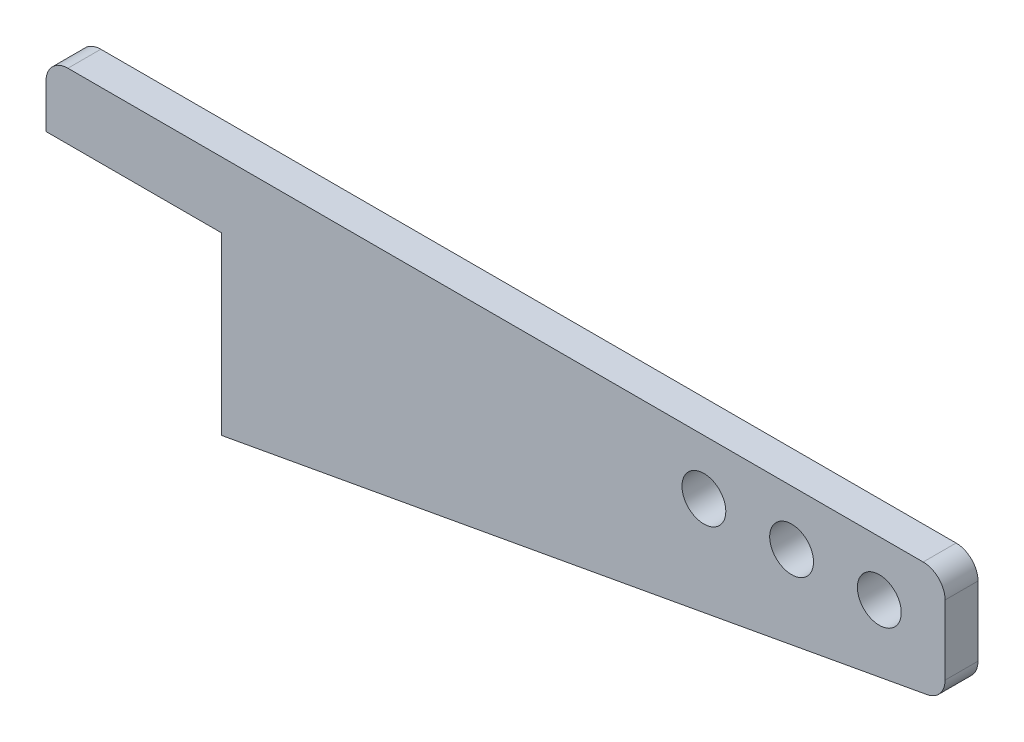
ISO-10303-21;
HEADER;
FILE_DESCRIPTION(('STEP AP214'),'2;1');
FILE_NAME('part.step','',(''),(''),'','','');
FILE_SCHEMA(('AUTOMOTIVE_DESIGN { 1 0 10303 214 1 1 1 1 }'));
ENDSEC;
DATA;
#1=APPLICATION_CONTEXT('core data for automotive mechanical design processes');
#2=APPLICATION_PROTOCOL_DEFINITION('international standard','automotive_design',2000,#1);
#3=PRODUCT_CONTEXT('',#1,'mechanical');
#4=PRODUCT('Part','Part','',(#3));
#5=PRODUCT_RELATED_PRODUCT_CATEGORY('part','',(#4));
#6=PRODUCT_DEFINITION_FORMATION('','',#4);
#7=PRODUCT_DEFINITION_CONTEXT('part definition',#1,'design');
#8=PRODUCT_DEFINITION('design','',#6,#7);
#9=PRODUCT_DEFINITION_SHAPE('','',#8);
#10=(LENGTH_UNIT() NAMED_UNIT(*) SI_UNIT(.MILLI.,.METRE.));
#11=(NAMED_UNIT(*) PLANE_ANGLE_UNIT() SI_UNIT($,.RADIAN.));
#12=(NAMED_UNIT(*) SI_UNIT($,.STERADIAN.) SOLID_ANGLE_UNIT());
#13=UNCERTAINTY_MEASURE_WITH_UNIT(LENGTH_MEASURE(1.E-05),#10,'distance_accuracy_value','');
#14=(GEOMETRIC_REPRESENTATION_CONTEXT(3) GLOBAL_UNCERTAINTY_ASSIGNED_CONTEXT((#13)) GLOBAL_UNIT_ASSIGNED_CONTEXT((#10,
#11,#12)) REPRESENTATION_CONTEXT('',''));
#15=CARTESIAN_POINT('',(0.,0.,0.));
#16=DIRECTION('',(0.,0.,1.));
#17=DIRECTION('',(1.,0.,0.));
#18=AXIS2_PLACEMENT_3D('',#15,#16,#17);
#19=CARTESIAN_POINT('',(0.,0.,15.));
#20=DIRECTION('',(0.,0.,-1.));
#21=DIRECTION('',(-1.,0.,0.));
#22=AXIS2_PLACEMENT_3D('',#19,#20,#21);
#23=PLANE('',#22);
#24=DIRECTION('',(-1.,0.,0.));
#25=VECTOR('',#24,1.);
#26=CARTESIAN_POINT('',(0.,0.,15.));
#27=LINE('',#26,#25);
#28=CARTESIAN_POINT('',(400.,0.,15.));
#29=VERTEX_POINT('',#28);
#30=CARTESIAN_POINT('',(9.99999999999999,0.,15.));
#31=VERTEX_POINT('',#30);
#32=EDGE_CURVE('E186',#29,#31,#27,.T.);
#33=ORIENTED_EDGE('',*,*,#32,.T.);
#34=CARTESIAN_POINT('',(9.99999999999999,-10.,15.));
#35=DIRECTION('',(0.,0.,-1.));
#36=DIRECTION('',(-1.,0.,0.));
#37=AXIS2_PLACEMENT_3D('',#34,#35,#36);
#38=CIRCLE('',#37,10.);
#39=CARTESIAN_POINT('',(0.,-9.99999999999999,15.));
#40=VERTEX_POINT('',#39);
#41=EDGE_CURVE('E123',#31,#40,#38,.F.);
#42=ORIENTED_EDGE('',*,*,#41,.T.);
#43=DIRECTION('',(0.,-1.,0.));
#44=VECTOR('',#43,1.);
#45=CARTESIAN_POINT('',(0.,-30.,15.));
#46=LINE('',#45,#44);
#47=CARTESIAN_POINT('',(0.,-30.,15.));
#48=VERTEX_POINT('',#47);
#49=EDGE_CURVE('E116',#40,#48,#46,.T.);
#50=ORIENTED_EDGE('',*,*,#49,.T.);
#51=DIRECTION('',(1.,0.,0.));
#52=VECTOR('',#51,1.);
#53=CARTESIAN_POINT('',(80.,-30.,15.));
#54=LINE('',#53,#52);
#55=CARTESIAN_POINT('',(80.,-30.,15.));
#56=VERTEX_POINT('',#55);
#57=EDGE_CURVE('E120',#48,#56,#54,.T.);
#58=ORIENTED_EDGE('',*,*,#57,.T.);
#59=DIRECTION('',(0.,-1.,0.));
#60=VECTOR('',#59,1.);
#61=CARTESIAN_POINT('',(80.,-110.,15.));
#62=LINE('',#61,#60);
#63=CARTESIAN_POINT('',(80.,-110.,15.));
#64=VERTEX_POINT('',#63);
#65=EDGE_CURVE('E137',#56,#64,#62,.T.);
#66=ORIENTED_EDGE('',*,*,#65,.T.);
#67=DIRECTION('',(0.983869910099908,0.178885438199983,0.));
#68=VECTOR('',#67,1.);
#69=CARTESIAN_POINT('',(410.,-50.,15.));
#70=LINE('',#69,#68);
#71=CARTESIAN_POINT('',(401.788854382,-51.4929355669091,15.));
#72=VERTEX_POINT('',#71);
#73=EDGE_CURVE('E192',#64,#72,#70,.T.);
#74=ORIENTED_EDGE('',*,*,#73,.T.);
#75=CARTESIAN_POINT('',(400.,-41.6542364659101,15.));
#76=DIRECTION('',(0.,0.,-1.));
#77=DIRECTION('',(-1.,0.,0.));
#78=AXIS2_PLACEMENT_3D('',#75,#76,#77);
#79=CIRCLE('',#78,10.);
#80=CARTESIAN_POINT('',(410.,-41.65423646591,15.));
#81=VERTEX_POINT('',#80);
#82=EDGE_CURVE('E68',#72,#81,#79,.F.);
#83=ORIENTED_EDGE('',*,*,#82,.T.);
#84=DIRECTION('',(0.,1.,0.));
#85=VECTOR('',#84,1.);
#86=CARTESIAN_POINT('',(410.,0.,15.));
#87=LINE('',#86,#85);
#88=CARTESIAN_POINT('',(410.,-9.99999999999999,15.));
#89=VERTEX_POINT('',#88);
#90=EDGE_CURVE('E170',#81,#89,#87,.T.);
#91=ORIENTED_EDGE('',*,*,#90,.T.);
#92=CARTESIAN_POINT('',(400.,-10.,15.));
#93=DIRECTION('',(0.,0.,-1.));
#94=DIRECTION('',(-1.,0.,0.));
#95=AXIS2_PLACEMENT_3D('',#92,#93,#94);
#96=CIRCLE('',#95,10.);
#97=EDGE_CURVE('E161',#89,#29,#96,.F.);
#98=ORIENTED_EDGE('',*,*,#97,.T.);
#99=EDGE_LOOP('',(#33,#42,#50,#58,#66,#74,#83,#91,#98));
#100=FACE_BOUND('',#99,.T.);
#101=CARTESIAN_POINT('',(300.,-25.,15.));
#102=DIRECTION('',(0.,0.,1.));
#103=DIRECTION('',(1.,0.,0.));
#104=AXIS2_PLACEMENT_3D('',#101,#102,#103);
#105=CIRCLE('',#104,9.99999999999998);
#106=CARTESIAN_POINT('',(310.,-25.,15.));
#107=VERTEX_POINT('',#106);
#108=EDGE_CURVE('E198',#107,#107,#105,.T.);
#109=ORIENTED_EDGE('',*,*,#108,.F.);
#110=EDGE_LOOP('',(#109));
#111=FACE_BOUND('',#110,.T.);
#112=CARTESIAN_POINT('',(340.,-25.,15.));
#113=DIRECTION('',(0.,0.,1.));
#114=DIRECTION('',(1.,0.,0.));
#115=AXIS2_PLACEMENT_3D('',#112,#113,#114);
#116=CIRCLE('',#115,9.99999999999998);
#117=CARTESIAN_POINT('',(350.,-25.,15.));
#118=VERTEX_POINT('',#117);
#119=EDGE_CURVE('E339',#118,#118,#116,.T.);
#120=ORIENTED_EDGE('',*,*,#119,.F.);
#121=EDGE_LOOP('',(#120));
#122=FACE_BOUND('',#121,.T.);
#123=CARTESIAN_POINT('',(380.,-25.,15.));
#124=DIRECTION('',(0.,0.,1.));
#125=DIRECTION('',(1.,0.,0.));
#126=AXIS2_PLACEMENT_3D('',#123,#124,#125);
#127=CIRCLE('',#126,9.99999999999998);
#128=CARTESIAN_POINT('',(390.,-25.,15.));
#129=VERTEX_POINT('',#128);
#130=EDGE_CURVE('E330',#129,#129,#127,.T.);
#131=ORIENTED_EDGE('',*,*,#130,.F.);
#132=EDGE_LOOP('',(#131));
#133=FACE_BOUND('',#132,.T.);
#134=ADVANCED_FACE('F46',(#100,#111,#122,#133),#23,.F.);
#135=CARTESIAN_POINT('',(0.,0.,0.));
#136=DIRECTION('',(0.,0.,-1.));
#137=DIRECTION('',(-1.,0.,0.));
#138=AXIS2_PLACEMENT_3D('',#135,#136,#137);
#139=PLANE('',#138);
#140=CARTESIAN_POINT('',(340.,-25.,0.));
#141=DIRECTION('',(0.,0.,1.));
#142=DIRECTION('',(1.,0.,0.));
#143=AXIS2_PLACEMENT_3D('',#140,#141,#142);
#144=CIRCLE('',#143,9.99999999999998);
#145=CARTESIAN_POINT('',(350.,-25.,0.));
#146=VERTEX_POINT('',#145);
#147=EDGE_CURVE('E336',#146,#146,#144,.T.);
#148=ORIENTED_EDGE('',*,*,#147,.T.);
#149=EDGE_LOOP('',(#148));
#150=FACE_BOUND('',#149,.T.);
#151=DIRECTION('',(0.,-1.,0.));
#152=VECTOR('',#151,1.);
#153=CARTESIAN_POINT('',(0.,-30.,0.));
#154=LINE('',#153,#152);
#155=CARTESIAN_POINT('',(0.,-9.99999999999999,0.));
#156=VERTEX_POINT('',#155);
#157=CARTESIAN_POINT('',(0.,-30.,0.));
#158=VERTEX_POINT('',#157);
#159=EDGE_CURVE('E141',#156,#158,#154,.T.);
#160=ORIENTED_EDGE('',*,*,#159,.F.);
#161=CARTESIAN_POINT('',(9.99999999999999,-10.,0.));
#162=DIRECTION('',(0.,0.,-1.));
#163=DIRECTION('',(-1.,0.,0.));
#164=AXIS2_PLACEMENT_3D('',#161,#162,#163);
#165=CIRCLE('',#164,10.);
#166=CARTESIAN_POINT('',(9.99999999999999,0.,0.));
#167=VERTEX_POINT('',#166);
#168=EDGE_CURVE('E154',#156,#167,#165,.T.);
#169=ORIENTED_EDGE('',*,*,#168,.T.);
#170=DIRECTION('',(-1.,0.,0.));
#171=VECTOR('',#170,1.);
#172=CARTESIAN_POINT('',(0.,0.,0.));
#173=LINE('',#172,#171);
#174=CARTESIAN_POINT('',(400.,0.,0.));
#175=VERTEX_POINT('',#174);
#176=EDGE_CURVE('E128',#175,#167,#173,.T.);
#177=ORIENTED_EDGE('',*,*,#176,.F.);
#178=CARTESIAN_POINT('',(400.,-10.,0.));
#179=DIRECTION('',(0.,0.,-1.));
#180=DIRECTION('',(-1.,0.,0.));
#181=AXIS2_PLACEMENT_3D('',#178,#179,#180);
#182=CIRCLE('',#181,10.);
#183=CARTESIAN_POINT('',(410.,-9.99999999999999,0.));
#184=VERTEX_POINT('',#183);
#185=EDGE_CURVE('E145',#175,#184,#182,.T.);
#186=ORIENTED_EDGE('',*,*,#185,.T.);
#187=DIRECTION('',(0.,1.,0.));
#188=VECTOR('',#187,1.);
#189=CARTESIAN_POINT('',(410.,0.,0.));
#190=LINE('',#189,#188);
#191=CARTESIAN_POINT('',(410.,-41.65423646591,0.));
#192=VERTEX_POINT('',#191);
#193=EDGE_CURVE('E169',#192,#184,#190,.T.);
#194=ORIENTED_EDGE('',*,*,#193,.F.);
#195=CARTESIAN_POINT('',(400.,-41.6542364659101,0.));
#196=DIRECTION('',(0.,0.,-1.));
#197=DIRECTION('',(-1.,0.,0.));
#198=AXIS2_PLACEMENT_3D('',#195,#196,#197);
#199=CIRCLE('',#198,10.);
#200=CARTESIAN_POINT('',(401.788854382,-51.4929355669091,0.));
#201=VERTEX_POINT('',#200);
#202=EDGE_CURVE('E152',#192,#201,#199,.T.);
#203=ORIENTED_EDGE('',*,*,#202,.T.);
#204=DIRECTION('',(0.983869910099908,0.178885438199983,0.));
#205=VECTOR('',#204,1.);
#206=CARTESIAN_POINT('',(410.,-50.,0.));
#207=LINE('',#206,#205);
#208=CARTESIAN_POINT('',(80.,-110.,0.));
#209=VERTEX_POINT('',#208);
#210=EDGE_CURVE('E178',#209,#201,#207,.T.);
#211=ORIENTED_EDGE('',*,*,#210,.F.);
#212=DIRECTION('',(0.,-1.,0.));
#213=VECTOR('',#212,1.);
#214=CARTESIAN_POINT('',(80.,-110.,0.));
#215=LINE('',#214,#213);
#216=CARTESIAN_POINT('',(80.,-30.,0.));
#217=VERTEX_POINT('',#216);
#218=EDGE_CURVE('E182',#217,#209,#215,.T.);
#219=ORIENTED_EDGE('',*,*,#218,.F.);
#220=DIRECTION('',(1.,0.,0.));
#221=VECTOR('',#220,1.);
#222=CARTESIAN_POINT('',(80.,-30.,0.));
#223=LINE('',#222,#221);
#224=EDGE_CURVE('E197',#158,#217,#223,.T.);
#225=ORIENTED_EDGE('',*,*,#224,.F.);
#226=EDGE_LOOP('',(#160,#169,#177,#186,#194,#203,#211,#219,#225));
#227=FACE_BOUND('',#226,.T.);
#228=CARTESIAN_POINT('',(300.,-25.,0.));
#229=DIRECTION('',(0.,0.,1.));
#230=DIRECTION('',(1.,0.,0.));
#231=AXIS2_PLACEMENT_3D('',#228,#229,#230);
#232=CIRCLE('',#231,9.99999999999998);
#233=CARTESIAN_POINT('',(310.,-25.,0.));
#234=VERTEX_POINT('',#233);
#235=EDGE_CURVE('E342',#234,#234,#232,.T.);
#236=ORIENTED_EDGE('',*,*,#235,.T.);
#237=EDGE_LOOP('',(#236));
#238=FACE_BOUND('',#237,.T.);
#239=CARTESIAN_POINT('',(380.,-25.,0.));
#240=DIRECTION('',(0.,0.,1.));
#241=DIRECTION('',(1.,0.,0.));
#242=AXIS2_PLACEMENT_3D('',#239,#240,#241);
#243=CIRCLE('',#242,9.99999999999998);
#244=CARTESIAN_POINT('',(390.,-25.,0.));
#245=VERTEX_POINT('',#244);
#246=EDGE_CURVE('E333',#245,#245,#243,.T.);
#247=ORIENTED_EDGE('',*,*,#246,.T.);
#248=EDGE_LOOP('',(#247));
#249=FACE_BOUND('',#248,.T.);
#250=ADVANCED_FACE('F173',(#150,#227,#238,#249),#139,.T.);
#251=CARTESIAN_POINT('',(0.,-30.,15.));
#252=DIRECTION('',(1.,0.,0.));
#253=DIRECTION('',(0.,1.,0.));
#254=AXIS2_PLACEMENT_3D('',#251,#252,#253);
#255=PLANE('',#254);
#256=ORIENTED_EDGE('',*,*,#49,.F.);
#257=DIRECTION('',(0.,0.,-1.));
#258=VECTOR('',#257,1.);
#259=CARTESIAN_POINT('',(0.,-9.99999999999999,15.));
#260=LINE('',#259,#258);
#261=EDGE_CURVE('E143',#40,#156,#260,.T.);
#262=ORIENTED_EDGE('',*,*,#261,.T.);
#263=ORIENTED_EDGE('',*,*,#159,.T.);
#264=DIRECTION('',(0.,0.,-1.));
#265=VECTOR('',#264,1.);
#266=CARTESIAN_POINT('',(0.,-30.,15.));
#267=LINE('',#266,#265);
#268=EDGE_CURVE('E133',#48,#158,#267,.T.);
#269=ORIENTED_EDGE('',*,*,#268,.F.);
#270=EDGE_LOOP('',(#256,#262,#263,#269));
#271=FACE_BOUND('',#270,.T.);
#272=ADVANCED_FACE('F139',(#271),#255,.F.);
#273=CARTESIAN_POINT('',(80.,-30.,15.));
#274=DIRECTION('',(0.,1.,0.));
#275=DIRECTION('',(0.,0.,1.));
#276=AXIS2_PLACEMENT_3D('',#273,#274,#275);
#277=PLANE('',#276);
#278=ORIENTED_EDGE('',*,*,#224,.T.);
#279=DIRECTION('',(0.,0.,-1.));
#280=VECTOR('',#279,1.);
#281=CARTESIAN_POINT('',(80.,-30.,15.));
#282=LINE('',#281,#280);
#283=EDGE_CURVE('E135',#56,#217,#282,.T.);
#284=ORIENTED_EDGE('',*,*,#283,.F.);
#285=ORIENTED_EDGE('',*,*,#57,.F.);
#286=ORIENTED_EDGE('',*,*,#268,.T.);
#287=EDGE_LOOP('',(#278,#284,#285,#286));
#288=FACE_BOUND('',#287,.T.);
#289=ADVANCED_FACE('F132',(#288),#277,.F.);
#290=CARTESIAN_POINT('',(80.,-110.,15.));
#291=DIRECTION('',(1.,0.,0.));
#292=DIRECTION('',(0.,1.,0.));
#293=AXIS2_PLACEMENT_3D('',#290,#291,#292);
#294=PLANE('',#293);
#295=ORIENTED_EDGE('',*,*,#218,.T.);
#296=DIRECTION('',(0.,0.,-1.));
#297=VECTOR('',#296,1.);
#298=CARTESIAN_POINT('',(80.,-110.,15.));
#299=LINE('',#298,#297);
#300=EDGE_CURVE('E147',#64,#209,#299,.T.);
#301=ORIENTED_EDGE('',*,*,#300,.F.);
#302=ORIENTED_EDGE('',*,*,#65,.F.);
#303=ORIENTED_EDGE('',*,*,#283,.T.);
#304=EDGE_LOOP('',(#295,#301,#302,#303));
#305=FACE_BOUND('',#304,.T.);
#306=ADVANCED_FACE('F201',(#305),#294,.F.);
#307=CARTESIAN_POINT('',(410.,-50.,15.));
#308=DIRECTION('',(-0.178885438199983,0.983869910099907,0.));
#309=DIRECTION('',(-0.983869910099907,-0.178885438199983,0.));
#310=AXIS2_PLACEMENT_3D('',#307,#308,#309);
#311=PLANE('',#310);
#312=ORIENTED_EDGE('',*,*,#210,.T.);
#313=DIRECTION('',(0.,0.,-1.));
#314=VECTOR('',#313,1.);
#315=CARTESIAN_POINT('',(401.788854382,-51.4929355669091,15.));
#316=LINE('',#315,#314);
#317=EDGE_CURVE('E13',#201,#72,#316,.F.);
#318=ORIENTED_EDGE('',*,*,#317,.T.);
#319=ORIENTED_EDGE('',*,*,#73,.F.);
#320=ORIENTED_EDGE('',*,*,#300,.T.);
#321=EDGE_LOOP('',(#312,#318,#319,#320));
#322=FACE_BOUND('',#321,.T.);
#323=ADVANCED_FACE('F203',(#322),#311,.F.);
#324=CARTESIAN_POINT('',(410.,0.,15.));
#325=DIRECTION('',(-1.,0.,0.));
#326=DIRECTION('',(0.,-1.,0.));
#327=AXIS2_PLACEMENT_3D('',#324,#325,#326);
#328=PLANE('',#327);
#329=ORIENTED_EDGE('',*,*,#90,.F.);
#330=DIRECTION('',(0.,0.,-1.));
#331=VECTOR('',#330,1.);
#332=CARTESIAN_POINT('',(410.,-41.65423646591,15.));
#333=LINE('',#332,#331);
#334=EDGE_CURVE('E54',#81,#192,#333,.T.);
#335=ORIENTED_EDGE('',*,*,#334,.T.);
#336=ORIENTED_EDGE('',*,*,#193,.T.);
#337=DIRECTION('',(0.,0.,-1.));
#338=VECTOR('',#337,1.);
#339=CARTESIAN_POINT('',(410.,-9.99999999999999,15.));
#340=LINE('',#339,#338);
#341=EDGE_CURVE('E61',#184,#89,#340,.F.);
#342=ORIENTED_EDGE('',*,*,#341,.T.);
#343=EDGE_LOOP('',(#329,#335,#336,#342));
#344=FACE_BOUND('',#343,.T.);
#345=ADVANCED_FACE('F168',(#344),#328,.F.);
#346=CARTESIAN_POINT('',(0.,0.,15.));
#347=DIRECTION('',(0.,-1.,0.));
#348=DIRECTION('',(0.,0.,-1.));
#349=AXIS2_PLACEMENT_3D('',#346,#347,#348);
#350=PLANE('',#349);
#351=ORIENTED_EDGE('',*,*,#176,.T.);
#352=DIRECTION('',(0.,0.,-1.));
#353=VECTOR('',#352,1.);
#354=CARTESIAN_POINT('',(9.99999999999999,0.,15.));
#355=LINE('',#354,#353);
#356=EDGE_CURVE('E159',#167,#31,#355,.F.);
#357=ORIENTED_EDGE('',*,*,#356,.T.);
#358=ORIENTED_EDGE('',*,*,#32,.F.);
#359=DIRECTION('',(0.,0.,-1.));
#360=VECTOR('',#359,1.);
#361=CARTESIAN_POINT('',(400.,0.,15.));
#362=LINE('',#361,#360);
#363=EDGE_CURVE('E156',#29,#175,#362,.T.);
#364=ORIENTED_EDGE('',*,*,#363,.T.);
#365=EDGE_LOOP('',(#351,#357,#358,#364));
#366=FACE_BOUND('',#365,.T.);
#367=ADVANCED_FACE('F226',(#366),#350,.F.);
#368=CARTESIAN_POINT('',(300.,-25.,15.));
#369=DIRECTION('',(0.,0.,-1.));
#370=DIRECTION('',(-1.,0.,0.));
#371=AXIS2_PLACEMENT_3D('',#368,#369,#370);
#372=CYLINDRICAL_SURFACE('',#371,9.99999999999998);
#373=ORIENTED_EDGE('',*,*,#108,.T.);
#374=EDGE_LOOP('',(#373));
#375=FACE_BOUND('',#374,.T.);
#376=ORIENTED_EDGE('',*,*,#235,.F.);
#377=EDGE_LOOP('',(#376));
#378=FACE_BOUND('',#377,.T.);
#379=ADVANCED_FACE('F223',(#375,#378),#372,.F.);
#380=CARTESIAN_POINT('',(340.,-25.,15.));
#381=DIRECTION('',(0.,0.,-1.));
#382=DIRECTION('',(-1.,0.,0.));
#383=AXIS2_PLACEMENT_3D('',#380,#381,#382);
#384=CYLINDRICAL_SURFACE('',#383,9.99999999999998);
#385=ORIENTED_EDGE('',*,*,#119,.T.);
#386=EDGE_LOOP('',(#385));
#387=FACE_BOUND('',#386,.T.);
#388=ORIENTED_EDGE('',*,*,#147,.F.);
#389=EDGE_LOOP('',(#388));
#390=FACE_BOUND('',#389,.T.);
#391=ADVANCED_FACE('F270',(#387,#390),#384,.F.);
#392=CARTESIAN_POINT('',(380.,-25.,15.));
#393=DIRECTION('',(0.,0.,-1.));
#394=DIRECTION('',(-1.,0.,0.));
#395=AXIS2_PLACEMENT_3D('',#392,#393,#394);
#396=CYLINDRICAL_SURFACE('',#395,9.99999999999998);
#397=ORIENTED_EDGE('',*,*,#130,.T.);
#398=EDGE_LOOP('',(#397));
#399=FACE_BOUND('',#398,.T.);
#400=ORIENTED_EDGE('',*,*,#246,.F.);
#401=EDGE_LOOP('',(#400));
#402=FACE_BOUND('',#401,.T.);
#403=ADVANCED_FACE('F212',(#399,#402),#396,.F.);
#404=CARTESIAN_POINT('',(9.99999999999999,-10.,15.));
#405=DIRECTION('',(0.,0.,-1.));
#406=DIRECTION('',(-1.,0.,0.));
#407=AXIS2_PLACEMENT_3D('',#404,#405,#406);
#408=CYLINDRICAL_SURFACE('',#407,10.);
#409=ORIENTED_EDGE('',*,*,#41,.F.);
#410=ORIENTED_EDGE('',*,*,#356,.F.);
#411=ORIENTED_EDGE('',*,*,#168,.F.);
#412=ORIENTED_EDGE('',*,*,#261,.F.);
#413=EDGE_LOOP('',(#409,#410,#411,#412));
#414=FACE_BOUND('',#413,.T.);
#415=ADVANCED_FACE('F206',(#414),#408,.T.);
#416=CARTESIAN_POINT('',(400.,-41.6542364659101,15.));
#417=DIRECTION('',(0.,0.,-1.));
#418=DIRECTION('',(-1.,0.,0.));
#419=AXIS2_PLACEMENT_3D('',#416,#417,#418);
#420=CYLINDRICAL_SURFACE('',#419,10.);
#421=ORIENTED_EDGE('',*,*,#82,.F.);
#422=ORIENTED_EDGE('',*,*,#317,.F.);
#423=ORIENTED_EDGE('',*,*,#202,.F.);
#424=ORIENTED_EDGE('',*,*,#334,.F.);
#425=EDGE_LOOP('',(#421,#422,#423,#424));
#426=FACE_BOUND('',#425,.T.);
#427=ADVANCED_FACE('F204',(#426),#420,.T.);
#428=CARTESIAN_POINT('',(400.,-10.,15.));
#429=DIRECTION('',(0.,0.,-1.));
#430=DIRECTION('',(-1.,0.,0.));
#431=AXIS2_PLACEMENT_3D('',#428,#429,#430);
#432=CYLINDRICAL_SURFACE('',#431,10.);
#433=ORIENTED_EDGE('',*,*,#97,.F.);
#434=ORIENTED_EDGE('',*,*,#341,.F.);
#435=ORIENTED_EDGE('',*,*,#185,.F.);
#436=ORIENTED_EDGE('',*,*,#363,.F.);
#437=EDGE_LOOP('',(#433,#434,#435,#436));
#438=FACE_BOUND('',#437,.T.);
#439=ADVANCED_FACE('F48',(#438),#432,.T.);
#440=CLOSED_SHELL('',(#134,#250,#272,#289,#306,#323,#345,#367,#379,#391,#403,#415,#427,#439));
#441=MANIFOLD_SOLID_BREP('B2',#440);
#442=ADVANCED_BREP_SHAPE_REPRESENTATION('',(#18,#441),#14);
#443=SHAPE_DEFINITION_REPRESENTATION(#9,#442);
ENDSEC;
END-ISO-10303-21;
